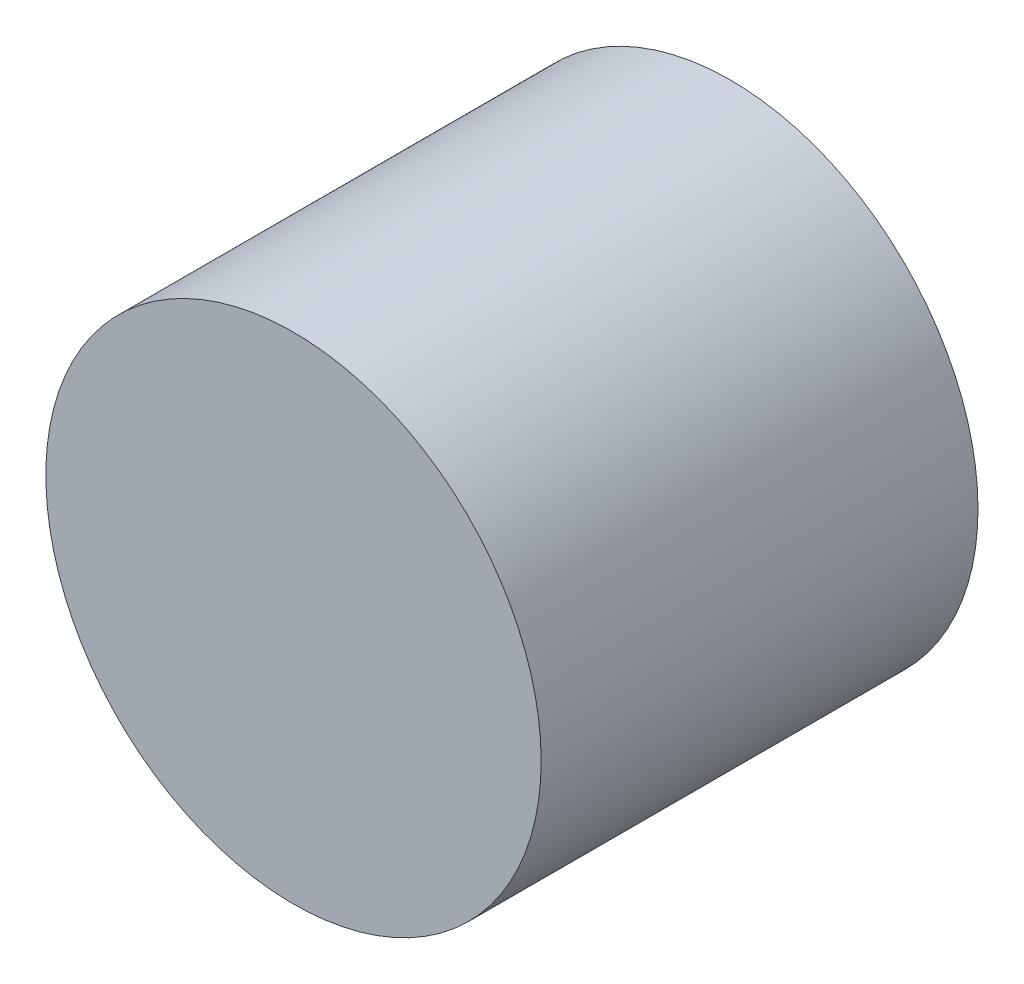
ISO-10303-21;
HEADER;
FILE_DESCRIPTION(('STEP AP214'),'2;1');
FILE_NAME('part.step','',(''),(''),'','','');
FILE_SCHEMA(('AUTOMOTIVE_DESIGN { 1 0 10303 214 1 1 1 1 }'));
ENDSEC;
DATA;
#1=APPLICATION_CONTEXT('core data for automotive mechanical design processes');
#2=APPLICATION_PROTOCOL_DEFINITION('international standard','automotive_design',2000,#1);
#3=PRODUCT_CONTEXT('',#1,'mechanical');
#4=PRODUCT('Part','Part','',(#3));
#5=PRODUCT_RELATED_PRODUCT_CATEGORY('part','',(#4));
#6=PRODUCT_DEFINITION_FORMATION('','',#4);
#7=PRODUCT_DEFINITION_CONTEXT('part definition',#1,'design');
#8=PRODUCT_DEFINITION('design','',#6,#7);
#9=PRODUCT_DEFINITION_SHAPE('','',#8);
#10=(LENGTH_UNIT() NAMED_UNIT(*) SI_UNIT(.MILLI.,.METRE.));
#11=(NAMED_UNIT(*) PLANE_ANGLE_UNIT() SI_UNIT($,.RADIAN.));
#12=(NAMED_UNIT(*) SI_UNIT($,.STERADIAN.) SOLID_ANGLE_UNIT());
#13=UNCERTAINTY_MEASURE_WITH_UNIT(LENGTH_MEASURE(1.E-05),#10,'distance_accuracy_value','');
#14=(GEOMETRIC_REPRESENTATION_CONTEXT(3) GLOBAL_UNCERTAINTY_ASSIGNED_CONTEXT((#13)) GLOBAL_UNIT_ASSIGNED_CONTEXT((#10,
#11,#12)) REPRESENTATION_CONTEXT('',''));
#15=CARTESIAN_POINT('',(0.,0.,0.));
#16=DIRECTION('',(0.,0.,1.));
#17=DIRECTION('',(1.,0.,0.));
#18=AXIS2_PLACEMENT_3D('',#15,#16,#17);
#19=CARTESIAN_POINT('',(0.,0.,12.7));
#20=DIRECTION('',(0.,0.,-1.));
#21=DIRECTION('',(-1.,0.,0.));
#22=AXIS2_PLACEMENT_3D('',#19,#20,#21);
#23=CYLINDRICAL_SURFACE('',#22,7.2);
#24=CARTESIAN_POINT('',(0.,0.,12.7));
#25=DIRECTION('',(0.,0.,1.));
#26=DIRECTION('',(1.,0.,0.));
#27=AXIS2_PLACEMENT_3D('',#24,#25,#26);
#28=CIRCLE('',#27,7.2);
#29=CARTESIAN_POINT('',(7.2,0.,12.7));
#30=VERTEX_POINT('',#29);
#31=EDGE_CURVE('E10',#30,#30,#28,.T.);
#32=ORIENTED_EDGE('',*,*,#31,.F.);
#33=EDGE_LOOP('',(#32));
#34=FACE_BOUND('',#33,.T.);
#35=CARTESIAN_POINT('',(0.,0.,0.));
#36=DIRECTION('',(0.,0.,1.));
#37=DIRECTION('',(1.,0.,0.));
#38=AXIS2_PLACEMENT_3D('',#35,#36,#37);
#39=CIRCLE('',#38,7.2);
#40=CARTESIAN_POINT('',(7.2,0.,0.));
#41=VERTEX_POINT('',#40);
#42=EDGE_CURVE('E40',#41,#41,#39,.T.);
#43=ORIENTED_EDGE('',*,*,#42,.T.);
#44=EDGE_LOOP('',(#43));
#45=FACE_BOUND('',#44,.T.);
#46=ADVANCED_FACE('F37',(#34,#45),#23,.T.);
#47=CARTESIAN_POINT('',(0.,0.,12.7));
#48=DIRECTION('',(0.,0.,1.));
#49=DIRECTION('',(1.,0.,0.));
#50=AXIS2_PLACEMENT_3D('',#47,#48,#49);
#51=PLANE('',#50);
#52=ORIENTED_EDGE('',*,*,#31,.T.);
#53=EDGE_LOOP('',(#52));
#54=FACE_BOUND('',#53,.T.);
#55=ADVANCED_FACE('F52',(#54),#51,.T.);
#56=CARTESIAN_POINT('',(0.,0.,0.));
#57=DIRECTION('',(0.,0.,1.));
#58=DIRECTION('',(1.,0.,0.));
#59=AXIS2_PLACEMENT_3D('',#56,#57,#58);
#60=PLANE('',#59);
#61=ORIENTED_EDGE('',*,*,#42,.F.);
#62=EDGE_LOOP('',(#61));
#63=FACE_BOUND('',#62,.T.);
#64=ADVANCED_FACE('F50',(#63),#60,.F.);
#65=CLOSED_SHELL('',(#46,#55,#64));
#66=MANIFOLD_SOLID_BREP('B2',#65);
#67=ADVANCED_BREP_SHAPE_REPRESENTATION('',(#18,#66),#14);
#68=SHAPE_DEFINITION_REPRESENTATION(#9,#67);
ENDSEC;
END-ISO-10303-21;
